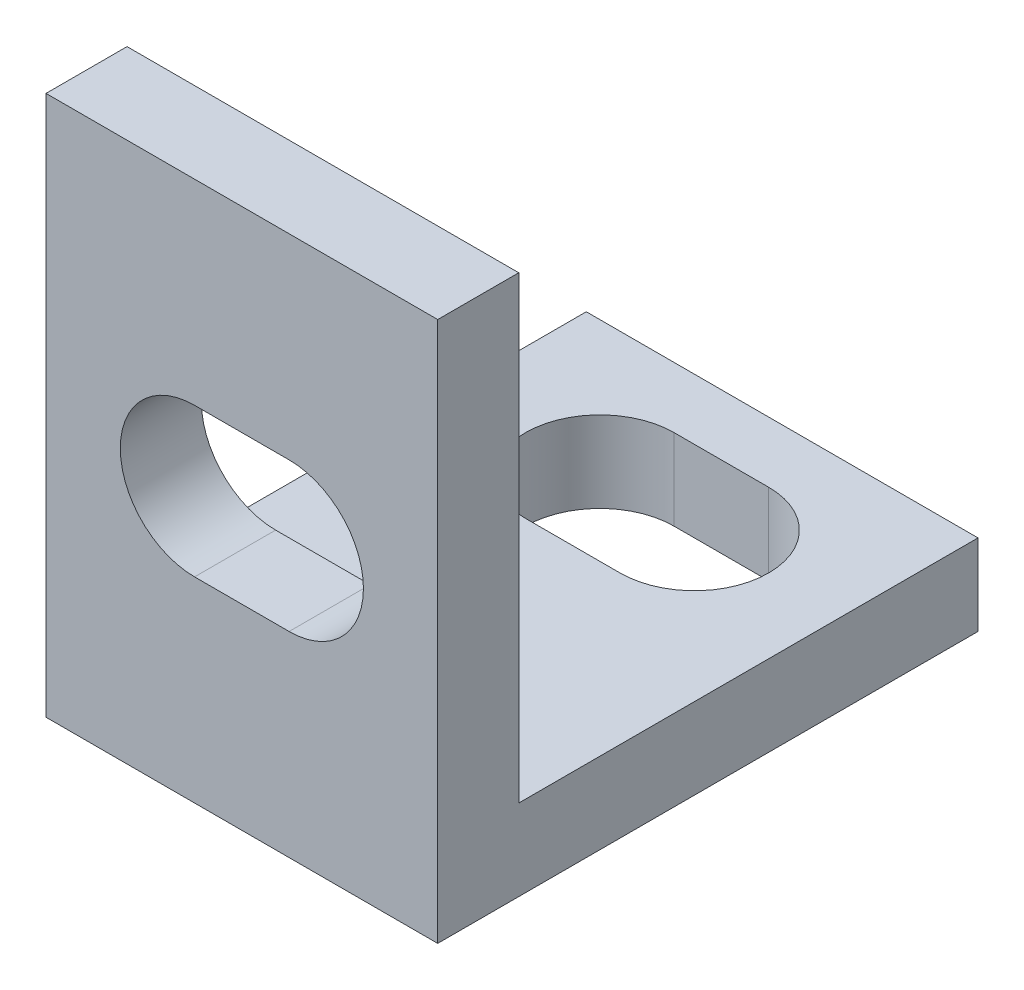
ISO-10303-21;
HEADER;
FILE_DESCRIPTION(('STEP AP214'),'2;1');
FILE_NAME('part.step','',(''),(''),'','','');
FILE_SCHEMA(('AUTOMOTIVE_DESIGN { 1 0 10303 214 1 1 1 1 }'));
ENDSEC;
DATA;
#1=APPLICATION_CONTEXT('core data for automotive mechanical design processes');
#2=APPLICATION_PROTOCOL_DEFINITION('international standard','automotive_design',2000,#1);
#3=PRODUCT_CONTEXT('',#1,'mechanical');
#4=PRODUCT('Part','Part','',(#3));
#5=PRODUCT_RELATED_PRODUCT_CATEGORY('part','',(#4));
#6=PRODUCT_DEFINITION_FORMATION('','',#4);
#7=PRODUCT_DEFINITION_CONTEXT('part definition',#1,'design');
#8=PRODUCT_DEFINITION('design','',#6,#7);
#9=PRODUCT_DEFINITION_SHAPE('','',#8);
#10=(LENGTH_UNIT() NAMED_UNIT(*) SI_UNIT(.MILLI.,.METRE.));
#11=(NAMED_UNIT(*) PLANE_ANGLE_UNIT() SI_UNIT($,.RADIAN.));
#12=(NAMED_UNIT(*) SI_UNIT($,.STERADIAN.) SOLID_ANGLE_UNIT());
#13=UNCERTAINTY_MEASURE_WITH_UNIT(LENGTH_MEASURE(1.E-05),#10,'distance_accuracy_value','');
#14=(GEOMETRIC_REPRESENTATION_CONTEXT(3) GLOBAL_UNCERTAINTY_ASSIGNED_CONTEXT((#13)) GLOBAL_UNIT_ASSIGNED_CONTEXT((#10,
#11,#12)) REPRESENTATION_CONTEXT('',''));
#15=CARTESIAN_POINT('',(0.,0.,0.));
#16=DIRECTION('',(0.,0.,1.));
#17=DIRECTION('',(1.,0.,0.));
#18=AXIS2_PLACEMENT_3D('',#15,#16,#17);
#19=CARTESIAN_POINT('',(-14.5,20.,-3.));
#20=DIRECTION('',(0.,1.,0.));
#21=DIRECTION('',(0.,0.,1.));
#22=AXIS2_PLACEMENT_3D('',#19,#20,#21);
#23=PLANE('',#22);
#24=DIRECTION('',(0.,0.,1.));
#25=VECTOR('',#24,1.);
#26=CARTESIAN_POINT('',(0.,20.,-3.));
#27=LINE('',#26,#25);
#28=CARTESIAN_POINT('',(0.,20.,-3.));
#29=VERTEX_POINT('',#28);
#30=CARTESIAN_POINT('',(0.,20.,0.));
#31=VERTEX_POINT('',#30);
#32=EDGE_CURVE('E195',#29,#31,#27,.T.);
#33=ORIENTED_EDGE('',*,*,#32,.F.);
#34=DIRECTION('',(1.,0.,0.));
#35=VECTOR('',#34,1.);
#36=CARTESIAN_POINT('',(-14.5,20.,-3.));
#37=LINE('',#36,#35);
#38=CARTESIAN_POINT('',(-14.5,20.,-3.));
#39=VERTEX_POINT('',#38);
#40=EDGE_CURVE('E11',#39,#29,#37,.T.);
#41=ORIENTED_EDGE('',*,*,#40,.F.);
#42=DIRECTION('',(0.,0.,1.));
#43=VECTOR('',#42,1.);
#44=CARTESIAN_POINT('',(-14.5,20.,-3.));
#45=LINE('',#44,#43);
#46=CARTESIAN_POINT('',(-14.5,20.,0.));
#47=VERTEX_POINT('',#46);
#48=EDGE_CURVE('E202',#39,#47,#45,.T.);
#49=ORIENTED_EDGE('',*,*,#48,.T.);
#50=DIRECTION('',(1.,0.,0.));
#51=VECTOR('',#50,1.);
#52=CARTESIAN_POINT('',(-14.5,20.,0.));
#53=LINE('',#52,#51);
#54=EDGE_CURVE('E36',#47,#31,#53,.T.);
#55=ORIENTED_EDGE('',*,*,#54,.T.);
#56=EDGE_LOOP('',(#33,#41,#49,#55));
#57=FACE_BOUND('',#56,.T.);
#58=ADVANCED_FACE('F33',(#57),#23,.T.);
#59=CARTESIAN_POINT('',(-14.5,3.,-3.));
#60=DIRECTION('',(0.,0.,-1.));
#61=DIRECTION('',(0.,1.,0.));
#62=AXIS2_PLACEMENT_3D('',#59,#60,#61);
#63=PLANE('',#62);
#64=CARTESIAN_POINT('',(-5.5,10.,-3.));
#65=DIRECTION('',(0.,0.,-1.));
#66=DIRECTION('',(0.,1.,0.));
#67=AXIS2_PLACEMENT_3D('',#64,#65,#66);
#68=CIRCLE('',#67,2.75);
#69=CARTESIAN_POINT('',(-5.5,12.75,-3.));
#70=VERTEX_POINT('',#69);
#71=CARTESIAN_POINT('',(-5.5,7.25,-3.));
#72=VERTEX_POINT('',#71);
#73=EDGE_CURVE('E167',#70,#72,#68,.T.);
#74=ORIENTED_EDGE('',*,*,#73,.F.);
#75=DIRECTION('',(-1.,0.,0.));
#76=VECTOR('',#75,1.);
#77=CARTESIAN_POINT('',(-5.5,12.75,-3.));
#78=LINE('',#77,#76);
#79=CARTESIAN_POINT('',(-9.,12.75,-3.));
#80=VERTEX_POINT('',#79);
#81=EDGE_CURVE('E175',#70,#80,#78,.T.);
#82=ORIENTED_EDGE('',*,*,#81,.T.);
#83=CARTESIAN_POINT('',(-9.,10.,-3.));
#84=DIRECTION('',(0.,0.,-1.));
#85=DIRECTION('',(0.,1.,0.));
#86=AXIS2_PLACEMENT_3D('',#83,#84,#85);
#87=CIRCLE('',#86,2.75);
#88=CARTESIAN_POINT('',(-9.,7.25000000000001,-3.));
#89=VERTEX_POINT('',#88);
#90=EDGE_CURVE('E188',#89,#80,#87,.T.);
#91=ORIENTED_EDGE('',*,*,#90,.F.);
#92=DIRECTION('',(-1.,0.,0.));
#93=VECTOR('',#92,1.);
#94=CARTESIAN_POINT('',(-5.5,7.25,-3.));
#95=LINE('',#94,#93);
#96=EDGE_CURVE('E185',#72,#89,#95,.T.);
#97=ORIENTED_EDGE('',*,*,#96,.F.);
#98=EDGE_LOOP('',(#74,#82,#91,#97));
#99=FACE_BOUND('',#98,.T.);
#100=DIRECTION('',(0.,1.,0.));
#101=VECTOR('',#100,1.);
#102=CARTESIAN_POINT('',(0.,3.,-3.));
#103=LINE('',#102,#101);
#104=CARTESIAN_POINT('',(0.,3.,-3.));
#105=VERTEX_POINT('',#104);
#106=EDGE_CURVE('E206',#105,#29,#103,.T.);
#107=ORIENTED_EDGE('',*,*,#106,.F.);
#108=DIRECTION('',(1.,0.,0.));
#109=VECTOR('',#108,1.);
#110=CARTESIAN_POINT('',(-14.5,3.,-3.));
#111=LINE('',#110,#109);
#112=CARTESIAN_POINT('',(-14.5,3.,-3.));
#113=VERTEX_POINT('',#112);
#114=EDGE_CURVE('E41',#113,#105,#111,.T.);
#115=ORIENTED_EDGE('',*,*,#114,.F.);
#116=DIRECTION('',(0.,1.,0.));
#117=VECTOR('',#116,1.);
#118=CARTESIAN_POINT('',(-14.5,3.,-3.));
#119=LINE('',#118,#117);
#120=EDGE_CURVE('E218',#113,#39,#119,.T.);
#121=ORIENTED_EDGE('',*,*,#120,.T.);
#122=ORIENTED_EDGE('',*,*,#40,.T.);
#123=EDGE_LOOP('',(#107,#115,#121,#122));
#124=FACE_BOUND('',#123,.T.);
#125=ADVANCED_FACE('F255',(#99,#124),#63,.T.);
#126=CARTESIAN_POINT('',(-14.5,3.,-20.));
#127=DIRECTION('',(0.,1.,0.));
#128=DIRECTION('',(0.,0.,1.));
#129=AXIS2_PLACEMENT_3D('',#126,#127,#128);
#130=PLANE('',#129);
#131=CARTESIAN_POINT('',(-5.5,3.,-15.));
#132=DIRECTION('',(0.,1.,0.));
#133=DIRECTION('',(0.,0.,1.));
#134=AXIS2_PLACEMENT_3D('',#131,#132,#133);
#135=CIRCLE('',#134,2.75);
#136=CARTESIAN_POINT('',(-5.5,3.,-12.25));
#137=VERTEX_POINT('',#136);
#138=CARTESIAN_POINT('',(-5.5,3.,-17.75));
#139=VERTEX_POINT('',#138);
#140=EDGE_CURVE('E49',#137,#139,#135,.T.);
#141=ORIENTED_EDGE('',*,*,#140,.F.);
#142=DIRECTION('',(1.,0.,0.));
#143=VECTOR('',#142,1.);
#144=CARTESIAN_POINT('',(-5.5,3.,-12.25));
#145=LINE('',#144,#143);
#146=CARTESIAN_POINT('',(-9.,3.,-12.25));
#147=VERTEX_POINT('',#146);
#148=EDGE_CURVE('E152',#147,#137,#145,.T.);
#149=ORIENTED_EDGE('',*,*,#148,.F.);
#150=CARTESIAN_POINT('',(-9.,3.,-15.));
#151=DIRECTION('',(0.,1.,0.));
#152=DIRECTION('',(0.,0.,1.));
#153=AXIS2_PLACEMENT_3D('',#150,#151,#152);
#154=CIRCLE('',#153,2.75);
#155=CARTESIAN_POINT('',(-9.,3.,-17.75));
#156=VERTEX_POINT('',#155);
#157=EDGE_CURVE('E155',#156,#147,#154,.T.);
#158=ORIENTED_EDGE('',*,*,#157,.F.);
#159=DIRECTION('',(-1.,0.,0.));
#160=VECTOR('',#159,1.);
#161=CARTESIAN_POINT('',(-5.5,3.,-17.75));
#162=LINE('',#161,#160);
#163=EDGE_CURVE('E161',#139,#156,#162,.T.);
#164=ORIENTED_EDGE('',*,*,#163,.F.);
#165=EDGE_LOOP('',(#141,#149,#158,#164));
#166=FACE_BOUND('',#165,.T.);
#167=DIRECTION('',(0.,0.,1.));
#168=VECTOR('',#167,1.);
#169=CARTESIAN_POINT('',(0.,3.,-20.));
#170=LINE('',#169,#168);
#171=CARTESIAN_POINT('',(0.,3.,-20.));
#172=VERTEX_POINT('',#171);
#173=EDGE_CURVE('E232',#172,#105,#170,.T.);
#174=ORIENTED_EDGE('',*,*,#173,.F.);
#175=DIRECTION('',(1.,0.,0.));
#176=VECTOR('',#175,1.);
#177=CARTESIAN_POINT('',(-14.5,3.,-20.));
#178=LINE('',#177,#176);
#179=CARTESIAN_POINT('',(-14.5,3.,-20.));
#180=VERTEX_POINT('',#179);
#181=EDGE_CURVE('E238',#180,#172,#178,.T.);
#182=ORIENTED_EDGE('',*,*,#181,.F.);
#183=DIRECTION('',(0.,0.,1.));
#184=VECTOR('',#183,1.);
#185=CARTESIAN_POINT('',(-14.5,3.,-20.));
#186=LINE('',#185,#184);
#187=EDGE_CURVE('E215',#180,#113,#186,.T.);
#188=ORIENTED_EDGE('',*,*,#187,.T.);
#189=ORIENTED_EDGE('',*,*,#114,.T.);
#190=EDGE_LOOP('',(#174,#182,#188,#189));
#191=FACE_BOUND('',#190,.T.);
#192=ADVANCED_FACE('F266',(#166,#191),#130,.T.);
#193=CARTESIAN_POINT('',(-14.5,0.,-20.));
#194=DIRECTION('',(0.,0.,-1.));
#195=DIRECTION('',(-1.,0.,0.));
#196=AXIS2_PLACEMENT_3D('',#193,#194,#195);
#197=PLANE('',#196);
#198=DIRECTION('',(0.,1.,0.));
#199=VECTOR('',#198,1.);
#200=CARTESIAN_POINT('',(0.,0.,-20.));
#201=LINE('',#200,#199);
#202=CARTESIAN_POINT('',(0.,0.,-20.));
#203=VERTEX_POINT('',#202);
#204=EDGE_CURVE('E229',#203,#172,#201,.T.);
#205=ORIENTED_EDGE('',*,*,#204,.F.);
#206=DIRECTION('',(1.,0.,0.));
#207=VECTOR('',#206,1.);
#208=CARTESIAN_POINT('',(-14.5,0.,-20.));
#209=LINE('',#208,#207);
#210=CARTESIAN_POINT('',(-14.5,0.,-20.));
#211=VERTEX_POINT('',#210);
#212=EDGE_CURVE('E240',#211,#203,#209,.T.);
#213=ORIENTED_EDGE('',*,*,#212,.F.);
#214=DIRECTION('',(0.,1.,0.));
#215=VECTOR('',#214,1.);
#216=CARTESIAN_POINT('',(-14.5,0.,-20.));
#217=LINE('',#216,#215);
#218=EDGE_CURVE('E212',#211,#180,#217,.T.);
#219=ORIENTED_EDGE('',*,*,#218,.T.);
#220=ORIENTED_EDGE('',*,*,#181,.T.);
#221=EDGE_LOOP('',(#205,#213,#219,#220));
#222=FACE_BOUND('',#221,.T.);
#223=ADVANCED_FACE('F264',(#222),#197,.T.);
#224=CARTESIAN_POINT('',(-14.5,0.,0.));
#225=DIRECTION('',(0.,-1.,0.));
#226=DIRECTION('',(0.,0.,-1.));
#227=AXIS2_PLACEMENT_3D('',#224,#225,#226);
#228=PLANE('',#227);
#229=CARTESIAN_POINT('',(-5.5,0.,-15.));
#230=DIRECTION('',(0.,1.,0.));
#231=DIRECTION('',(0.,0.,1.));
#232=AXIS2_PLACEMENT_3D('',#229,#230,#231);
#233=CIRCLE('',#232,2.75);
#234=CARTESIAN_POINT('',(-5.5,0.,-12.25));
#235=VERTEX_POINT('',#234);
#236=CARTESIAN_POINT('',(-5.5,0.,-17.75));
#237=VERTEX_POINT('',#236);
#238=EDGE_CURVE('E136',#235,#237,#233,.T.);
#239=ORIENTED_EDGE('',*,*,#238,.T.);
#240=DIRECTION('',(-1.,0.,0.));
#241=VECTOR('',#240,1.);
#242=CARTESIAN_POINT('',(-5.5,0.,-17.75));
#243=LINE('',#242,#241);
#244=CARTESIAN_POINT('',(-9.,0.,-17.75));
#245=VERTEX_POINT('',#244);
#246=EDGE_CURVE('E145',#237,#245,#243,.T.);
#247=ORIENTED_EDGE('',*,*,#246,.T.);
#248=CARTESIAN_POINT('',(-9.,0.,-15.));
#249=DIRECTION('',(0.,1.,0.));
#250=DIRECTION('',(0.,0.,1.));
#251=AXIS2_PLACEMENT_3D('',#248,#249,#250);
#252=CIRCLE('',#251,2.75);
#253=CARTESIAN_POINT('',(-9.,0.,-12.25));
#254=VERTEX_POINT('',#253);
#255=EDGE_CURVE('E57',#245,#254,#252,.T.);
#256=ORIENTED_EDGE('',*,*,#255,.T.);
#257=DIRECTION('',(1.,0.,0.));
#258=VECTOR('',#257,1.);
#259=CARTESIAN_POINT('',(-5.5,0.,-12.25));
#260=LINE('',#259,#258);
#261=EDGE_CURVE('E142',#254,#235,#260,.T.);
#262=ORIENTED_EDGE('',*,*,#261,.T.);
#263=EDGE_LOOP('',(#239,#247,#256,#262));
#264=FACE_BOUND('',#263,.T.);
#265=DIRECTION('',(0.,0.,-1.));
#266=VECTOR('',#265,1.);
#267=CARTESIAN_POINT('',(0.,0.,0.));
#268=LINE('',#267,#266);
#269=CARTESIAN_POINT('',(0.,0.,0.));
#270=VERTEX_POINT('',#269);
#271=EDGE_CURVE('E226',#270,#203,#268,.T.);
#272=ORIENTED_EDGE('',*,*,#271,.F.);
#273=DIRECTION('',(1.,0.,0.));
#274=VECTOR('',#273,1.);
#275=CARTESIAN_POINT('',(-14.5,0.,0.));
#276=LINE('',#275,#274);
#277=CARTESIAN_POINT('',(-14.5,0.,0.));
#278=VERTEX_POINT('',#277);
#279=EDGE_CURVE('E241',#278,#270,#276,.T.);
#280=ORIENTED_EDGE('',*,*,#279,.F.);
#281=DIRECTION('',(0.,0.,-1.));
#282=VECTOR('',#281,1.);
#283=CARTESIAN_POINT('',(-14.5,0.,0.));
#284=LINE('',#283,#282);
#285=EDGE_CURVE('E209',#278,#211,#284,.T.);
#286=ORIENTED_EDGE('',*,*,#285,.T.);
#287=ORIENTED_EDGE('',*,*,#212,.T.);
#288=EDGE_LOOP('',(#272,#280,#286,#287));
#289=FACE_BOUND('',#288,.T.);
#290=ADVANCED_FACE('F149',(#264,#289),#228,.T.);
#291=CARTESIAN_POINT('',(-14.5,20.,0.));
#292=DIRECTION('',(0.,0.,1.));
#293=DIRECTION('',(0.,-1.,0.));
#294=AXIS2_PLACEMENT_3D('',#291,#292,#293);
#295=PLANE('',#294);
#296=CARTESIAN_POINT('',(-5.5,10.,0.));
#297=DIRECTION('',(0.,0.,-1.));
#298=DIRECTION('',(0.,1.,0.));
#299=AXIS2_PLACEMENT_3D('',#296,#297,#298);
#300=CIRCLE('',#299,2.75);
#301=CARTESIAN_POINT('',(-5.5,12.75,0.));
#302=VERTEX_POINT('',#301);
#303=CARTESIAN_POINT('',(-5.5,7.25,0.));
#304=VERTEX_POINT('',#303);
#305=EDGE_CURVE('E171',#302,#304,#300,.T.);
#306=ORIENTED_EDGE('',*,*,#305,.T.);
#307=DIRECTION('',(-1.,0.,0.));
#308=VECTOR('',#307,1.);
#309=CARTESIAN_POINT('',(-5.5,7.25,0.));
#310=LINE('',#309,#308);
#311=CARTESIAN_POINT('',(-9.,7.25,0.));
#312=VERTEX_POINT('',#311);
#313=EDGE_CURVE('E174',#304,#312,#310,.T.);
#314=ORIENTED_EDGE('',*,*,#313,.T.);
#315=CARTESIAN_POINT('',(-9.,10.,0.));
#316=DIRECTION('',(0.,0.,-1.));
#317=DIRECTION('',(0.,1.,0.));
#318=AXIS2_PLACEMENT_3D('',#315,#316,#317);
#319=CIRCLE('',#318,2.75);
#320=CARTESIAN_POINT('',(-9.,12.75,0.));
#321=VERTEX_POINT('',#320);
#322=EDGE_CURVE('E178',#312,#321,#319,.T.);
#323=ORIENTED_EDGE('',*,*,#322,.T.);
#324=DIRECTION('',(-1.,0.,0.));
#325=VECTOR('',#324,1.);
#326=CARTESIAN_POINT('',(-5.5,12.75,0.));
#327=LINE('',#326,#325);
#328=EDGE_CURVE('E181',#302,#321,#327,.T.);
#329=ORIENTED_EDGE('',*,*,#328,.F.);
#330=EDGE_LOOP('',(#306,#314,#323,#329));
#331=FACE_BOUND('',#330,.T.);
#332=DIRECTION('',(0.,-1.,0.));
#333=VECTOR('',#332,1.);
#334=CARTESIAN_POINT('',(0.,20.,0.));
#335=LINE('',#334,#333);
#336=EDGE_CURVE('E223',#31,#270,#335,.T.);
#337=ORIENTED_EDGE('',*,*,#336,.F.);
#338=ORIENTED_EDGE('',*,*,#54,.F.);
#339=DIRECTION('',(0.,-1.,0.));
#340=VECTOR('',#339,1.);
#341=CARTESIAN_POINT('',(-14.5,20.,0.));
#342=LINE('',#341,#340);
#343=EDGE_CURVE('E205',#47,#278,#342,.T.);
#344=ORIENTED_EDGE('',*,*,#343,.T.);
#345=ORIENTED_EDGE('',*,*,#279,.T.);
#346=EDGE_LOOP('',(#337,#338,#344,#345));
#347=FACE_BOUND('',#346,.T.);
#348=ADVANCED_FACE('F249',(#331,#347),#295,.T.);
#349=CARTESIAN_POINT('',(-14.5,0.,0.));
#350=DIRECTION('',(1.,0.,0.));
#351=DIRECTION('',(0.,0.,-1.));
#352=AXIS2_PLACEMENT_3D('',#349,#350,#351);
#353=PLANE('',#352);
#354=ORIENTED_EDGE('',*,*,#48,.F.);
#355=ORIENTED_EDGE('',*,*,#120,.F.);
#356=ORIENTED_EDGE('',*,*,#187,.F.);
#357=ORIENTED_EDGE('',*,*,#218,.F.);
#358=ORIENTED_EDGE('',*,*,#285,.F.);
#359=ORIENTED_EDGE('',*,*,#343,.F.);
#360=EDGE_LOOP('',(#354,#355,#356,#357,#358,#359));
#361=FACE_BOUND('',#360,.T.);
#362=ADVANCED_FACE('F258',(#361),#353,.F.);
#363=CARTESIAN_POINT('',(0.,0.,0.));
#364=DIRECTION('',(1.,0.,0.));
#365=DIRECTION('',(0.,0.,-1.));
#366=AXIS2_PLACEMENT_3D('',#363,#364,#365);
#367=PLANE('',#366);
#368=ORIENTED_EDGE('',*,*,#32,.T.);
#369=ORIENTED_EDGE('',*,*,#336,.T.);
#370=ORIENTED_EDGE('',*,*,#271,.T.);
#371=ORIENTED_EDGE('',*,*,#204,.T.);
#372=ORIENTED_EDGE('',*,*,#173,.T.);
#373=ORIENTED_EDGE('',*,*,#106,.T.);
#374=EDGE_LOOP('',(#368,#369,#370,#371,#372,#373));
#375=FACE_BOUND('',#374,.T.);
#376=ADVANCED_FACE('F251',(#375),#367,.T.);
#377=CARTESIAN_POINT('',(-5.5,10.,0.));
#378=DIRECTION('',(0.,0.,-1.));
#379=DIRECTION('',(0.,1.,0.));
#380=AXIS2_PLACEMENT_3D('',#377,#378,#379);
#381=CYLINDRICAL_SURFACE('',#380,2.75);
#382=ORIENTED_EDGE('',*,*,#73,.T.);
#383=DIRECTION('',(0.,0.,-1.));
#384=VECTOR('',#383,1.);
#385=CARTESIAN_POINT('',(-5.5,7.25,0.));
#386=LINE('',#385,#384);
#387=EDGE_CURVE('E183',#304,#72,#386,.T.);
#388=ORIENTED_EDGE('',*,*,#387,.F.);
#389=ORIENTED_EDGE('',*,*,#305,.F.);
#390=DIRECTION('',(0.,0.,-1.));
#391=VECTOR('',#390,1.);
#392=CARTESIAN_POINT('',(-5.5,12.75,0.));
#393=LINE('',#392,#391);
#394=EDGE_CURVE('E193',#302,#70,#393,.T.);
#395=ORIENTED_EDGE('',*,*,#394,.T.);
#396=EDGE_LOOP('',(#382,#388,#389,#395));
#397=FACE_BOUND('',#396,.T.);
#398=ADVANCED_FACE('F308',(#397),#381,.F.);
#399=CARTESIAN_POINT('',(-5.5,12.75,0.));
#400=DIRECTION('',(0.,-1.,0.));
#401=DIRECTION('',(0.,0.,-1.));
#402=AXIS2_PLACEMENT_3D('',#399,#400,#401);
#403=PLANE('',#402);
#404=ORIENTED_EDGE('',*,*,#81,.F.);
#405=ORIENTED_EDGE('',*,*,#394,.F.);
#406=ORIENTED_EDGE('',*,*,#328,.T.);
#407=DIRECTION('',(0.,0.,-1.));
#408=VECTOR('',#407,1.);
#409=CARTESIAN_POINT('',(-9.,12.75,0.));
#410=LINE('',#409,#408);
#411=EDGE_CURVE('E196',#321,#80,#410,.T.);
#412=ORIENTED_EDGE('',*,*,#411,.T.);
#413=EDGE_LOOP('',(#404,#405,#406,#412));
#414=FACE_BOUND('',#413,.T.);
#415=ADVANCED_FACE('F313',(#414),#403,.T.);
#416=CARTESIAN_POINT('',(-9.,10.,0.));
#417=DIRECTION('',(0.,0.,-1.));
#418=DIRECTION('',(0.,1.,0.));
#419=AXIS2_PLACEMENT_3D('',#416,#417,#418);
#420=CYLINDRICAL_SURFACE('',#419,2.75);
#421=ORIENTED_EDGE('',*,*,#90,.T.);
#422=ORIENTED_EDGE('',*,*,#411,.F.);
#423=ORIENTED_EDGE('',*,*,#322,.F.);
#424=DIRECTION('',(0.,0.,-1.));
#425=VECTOR('',#424,1.);
#426=CARTESIAN_POINT('',(-9.,7.25000000000001,0.));
#427=LINE('',#426,#425);
#428=EDGE_CURVE('E198',#312,#89,#427,.T.);
#429=ORIENTED_EDGE('',*,*,#428,.T.);
#430=EDGE_LOOP('',(#421,#422,#423,#429));
#431=FACE_BOUND('',#430,.T.);
#432=ADVANCED_FACE('F323',(#431),#420,.F.);
#433=CARTESIAN_POINT('',(-5.5,7.25,0.));
#434=DIRECTION('',(0.,-1.,0.));
#435=DIRECTION('',(1.,0.,0.));
#436=AXIS2_PLACEMENT_3D('',#433,#434,#435);
#437=PLANE('',#436);
#438=ORIENTED_EDGE('',*,*,#96,.T.);
#439=ORIENTED_EDGE('',*,*,#428,.F.);
#440=ORIENTED_EDGE('',*,*,#313,.F.);
#441=ORIENTED_EDGE('',*,*,#387,.T.);
#442=EDGE_LOOP('',(#438,#439,#440,#441));
#443=FACE_BOUND('',#442,.T.);
#444=ADVANCED_FACE('F333',(#443),#437,.F.);
#445=CARTESIAN_POINT('',(-5.5,0.,-15.));
#446=DIRECTION('',(0.,1.,0.));
#447=DIRECTION('',(0.,0.,1.));
#448=AXIS2_PLACEMENT_3D('',#445,#446,#447);
#449=CYLINDRICAL_SURFACE('',#448,2.75);
#450=ORIENTED_EDGE('',*,*,#140,.T.);
#451=DIRECTION('',(0.,1.,0.));
#452=VECTOR('',#451,1.);
#453=CARTESIAN_POINT('',(-5.5,0.,-17.75));
#454=LINE('',#453,#452);
#455=EDGE_CURVE('E132',#237,#139,#454,.T.);
#456=ORIENTED_EDGE('',*,*,#455,.F.);
#457=ORIENTED_EDGE('',*,*,#238,.F.);
#458=DIRECTION('',(0.,1.,0.));
#459=VECTOR('',#458,1.);
#460=CARTESIAN_POINT('',(-5.5,0.,-12.25));
#461=LINE('',#460,#459);
#462=EDGE_CURVE('E165',#235,#137,#461,.T.);
#463=ORIENTED_EDGE('',*,*,#462,.T.);
#464=EDGE_LOOP('',(#450,#456,#457,#463));
#465=FACE_BOUND('',#464,.T.);
#466=ADVANCED_FACE('F134',(#465),#449,.F.);
#467=CARTESIAN_POINT('',(-5.5,0.,-12.25));
#468=DIRECTION('',(0.,0.,1.));
#469=DIRECTION('',(0.,-1.,0.));
#470=AXIS2_PLACEMENT_3D('',#467,#468,#469);
#471=PLANE('',#470);
#472=ORIENTED_EDGE('',*,*,#148,.T.);
#473=ORIENTED_EDGE('',*,*,#462,.F.);
#474=ORIENTED_EDGE('',*,*,#261,.F.);
#475=DIRECTION('',(0.,1.,0.));
#476=VECTOR('',#475,1.);
#477=CARTESIAN_POINT('',(-9.,0.,-12.25));
#478=LINE('',#477,#476);
#479=EDGE_CURVE('E168',#254,#147,#478,.T.);
#480=ORIENTED_EDGE('',*,*,#479,.T.);
#481=EDGE_LOOP('',(#472,#473,#474,#480));
#482=FACE_BOUND('',#481,.T.);
#483=ADVANCED_FACE('F362',(#482),#471,.F.);
#484=CARTESIAN_POINT('',(-9.,0.,-15.));
#485=DIRECTION('',(0.,1.,0.));
#486=DIRECTION('',(0.,0.,1.));
#487=AXIS2_PLACEMENT_3D('',#484,#485,#486);
#488=CYLINDRICAL_SURFACE('',#487,2.75);
#489=ORIENTED_EDGE('',*,*,#157,.T.);
#490=ORIENTED_EDGE('',*,*,#479,.F.);
#491=ORIENTED_EDGE('',*,*,#255,.F.);
#492=DIRECTION('',(0.,1.,0.));
#493=VECTOR('',#492,1.);
#494=CARTESIAN_POINT('',(-9.,0.,-17.75));
#495=LINE('',#494,#493);
#496=EDGE_CURVE('E141',#245,#156,#495,.T.);
#497=ORIENTED_EDGE('',*,*,#496,.T.);
#498=EDGE_LOOP('',(#489,#490,#491,#497));
#499=FACE_BOUND('',#498,.T.);
#500=ADVANCED_FACE('F371',(#499),#488,.F.);
#501=CARTESIAN_POINT('',(-5.5,0.,-17.75));
#502=DIRECTION('',(0.,0.,-1.));
#503=DIRECTION('',(0.,1.,0.));
#504=AXIS2_PLACEMENT_3D('',#501,#502,#503);
#505=PLANE('',#504);
#506=ORIENTED_EDGE('',*,*,#163,.T.);
#507=ORIENTED_EDGE('',*,*,#496,.F.);
#508=ORIENTED_EDGE('',*,*,#246,.F.);
#509=ORIENTED_EDGE('',*,*,#455,.T.);
#510=EDGE_LOOP('',(#506,#507,#508,#509));
#511=FACE_BOUND('',#510,.T.);
#512=ADVANCED_FACE('F146',(#511),#505,.F.);
#513=CLOSED_SHELL('',(#58,#125,#192,#223,#290,#348,#362,#376,#398,#415,#432,#444,#466,#483,#500,#512));
#514=MANIFOLD_SOLID_BREP('B2',#513);
#515=ADVANCED_BREP_SHAPE_REPRESENTATION('',(#18,#514),#14);
#516=SHAPE_DEFINITION_REPRESENTATION(#9,#515);
ENDSEC;
END-ISO-10303-21;
